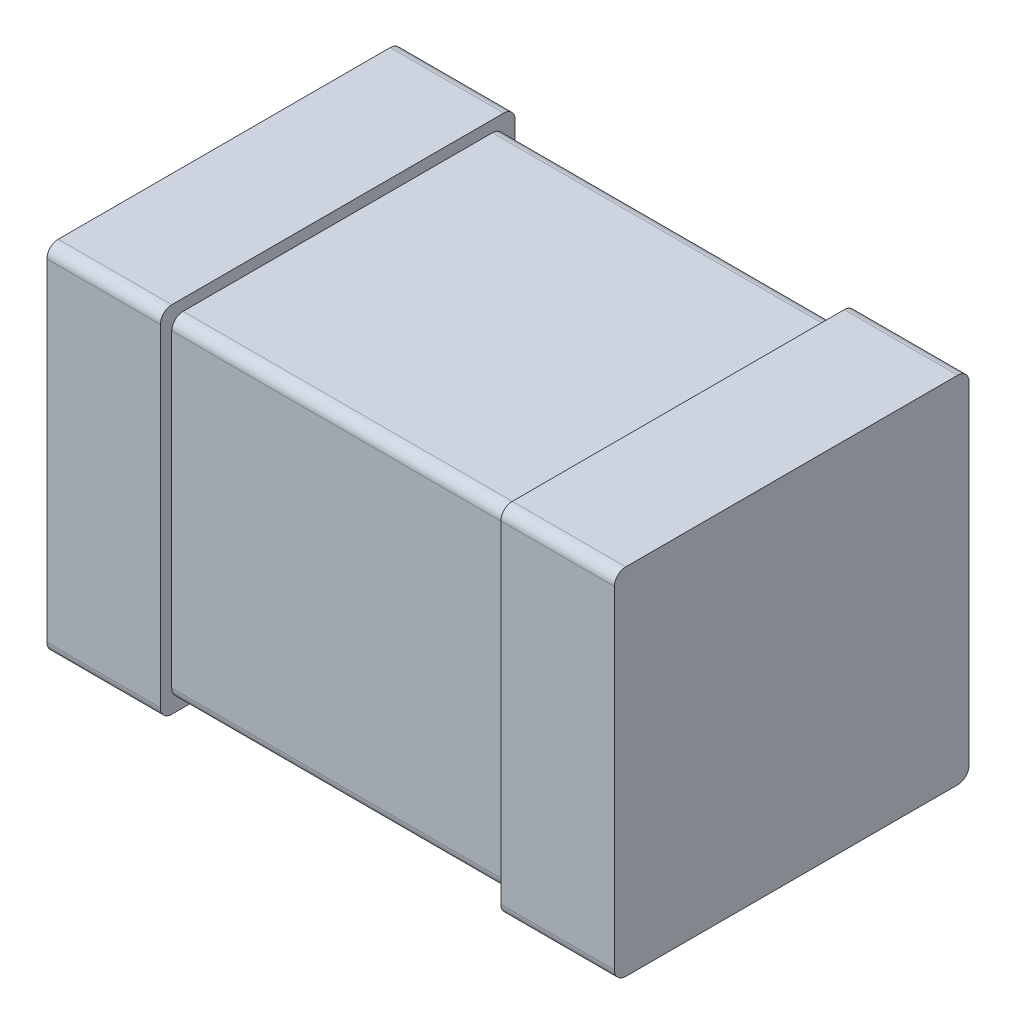
ISO-10303-21;
HEADER;
FILE_DESCRIPTION(('STEP AP214'),'2;1');
FILE_NAME('part.step','',(''),(''),'','','');
FILE_SCHEMA(('AUTOMOTIVE_DESIGN { 1 0 10303 214 1 1 1 1 }'));
ENDSEC;
DATA;
#1=APPLICATION_CONTEXT('core data for automotive mechanical design processes');
#2=APPLICATION_PROTOCOL_DEFINITION('international standard','automotive_design',2000,#1);
#3=PRODUCT_CONTEXT('',#1,'mechanical');
#4=PRODUCT('Part','Part','',(#3));
#5=PRODUCT_RELATED_PRODUCT_CATEGORY('part','',(#4));
#6=PRODUCT_DEFINITION_FORMATION('','',#4);
#7=PRODUCT_DEFINITION_CONTEXT('part definition',#1,'design');
#8=PRODUCT_DEFINITION('design','',#6,#7);
#9=PRODUCT_DEFINITION_SHAPE('','',#8);
#10=(LENGTH_UNIT() NAMED_UNIT(*) SI_UNIT(.MILLI.,.METRE.));
#11=(NAMED_UNIT(*) PLANE_ANGLE_UNIT() SI_UNIT($,.RADIAN.));
#12=(NAMED_UNIT(*) SI_UNIT($,.STERADIAN.) SOLID_ANGLE_UNIT());
#13=UNCERTAINTY_MEASURE_WITH_UNIT(LENGTH_MEASURE(1.E-05),#10,'distance_accuracy_value','');
#14=(GEOMETRIC_REPRESENTATION_CONTEXT(3) GLOBAL_UNCERTAINTY_ASSIGNED_CONTEXT((#13)) GLOBAL_UNIT_ASSIGNED_CONTEXT((#10,
#11,#12)) REPRESENTATION_CONTEXT('',''));
#15=CARTESIAN_POINT('',(0.,0.,0.));
#16=DIRECTION('',(0.,0.,1.));
#17=DIRECTION('',(1.,0.,0.));
#18=AXIS2_PLACEMENT_3D('',#15,#16,#17);
#19=CARTESIAN_POINT('',(1.,-0.625,0.));
#20=DIRECTION('',(1.,0.,0.));
#21=DIRECTION('',(0.,1.,0.));
#22=AXIS2_PLACEMENT_3D('',#19,#20,#21);
#23=PLANE('',#22);
#24=DIRECTION('',(0.,0.,1.));
#25=VECTOR('',#24,1.);
#26=CARTESIAN_POINT('',(1.,-0.625,0.));
#27=LINE('',#26,#25);
#28=CARTESIAN_POINT('',(1.,-0.625,0.04));
#29=VERTEX_POINT('',#28);
#30=CARTESIAN_POINT('',(1.,-0.625,1.21));
#31=VERTEX_POINT('',#30);
#32=EDGE_CURVE('E411',#29,#31,#27,.T.);
#33=ORIENTED_EDGE('',*,*,#32,.F.);
#34=CARTESIAN_POINT('',(1.,-0.585,0.04));
#35=DIRECTION('',(1.,0.,0.));
#36=DIRECTION('',(0.,0.,1.));
#37=AXIS2_PLACEMENT_3D('',#34,#35,#36);
#38=CIRCLE('',#37,0.04);
#39=CARTESIAN_POINT('',(1.,-0.585,0.));
#40=VERTEX_POINT('',#39);
#41=EDGE_CURVE('E402',#29,#40,#38,.T.);
#42=ORIENTED_EDGE('',*,*,#41,.T.);
#43=DIRECTION('',(0.,1.,0.));
#44=VECTOR('',#43,1.);
#45=CARTESIAN_POINT('',(1.,-0.625,0.));
#46=LINE('',#45,#44);
#47=CARTESIAN_POINT('',(1.,0.585,0.));
#48=VERTEX_POINT('',#47);
#49=EDGE_CURVE('E466',#40,#48,#46,.T.);
#50=ORIENTED_EDGE('',*,*,#49,.T.);
#51=CARTESIAN_POINT('',(1.,0.585,0.04));
#52=DIRECTION('',(-1.,0.,0.));
#53=DIRECTION('',(0.,0.,1.));
#54=AXIS2_PLACEMENT_3D('',#51,#52,#53);
#55=CIRCLE('',#54,0.04);
#56=CARTESIAN_POINT('',(1.,0.625,0.04));
#57=VERTEX_POINT('',#56);
#58=EDGE_CURVE('E503',#57,#48,#55,.T.);
#59=ORIENTED_EDGE('',*,*,#58,.F.);
#60=DIRECTION('',(0.,0.,1.));
#61=VECTOR('',#60,1.);
#62=CARTESIAN_POINT('',(1.,0.625,0.));
#63=LINE('',#62,#61);
#64=CARTESIAN_POINT('',(1.,0.625,1.21));
#65=VERTEX_POINT('',#64);
#66=EDGE_CURVE('E11',#57,#65,#63,.T.);
#67=ORIENTED_EDGE('',*,*,#66,.T.);
#68=CARTESIAN_POINT('',(1.,0.585,1.21));
#69=DIRECTION('',(1.,0.,0.));
#70=DIRECTION('',(0.,0.,1.));
#71=AXIS2_PLACEMENT_3D('',#68,#69,#70);
#72=CIRCLE('',#71,0.04);
#73=CARTESIAN_POINT('',(1.,0.585,1.25));
#74=VERTEX_POINT('',#73);
#75=EDGE_CURVE('E506',#65,#74,#72,.T.);
#76=ORIENTED_EDGE('',*,*,#75,.T.);
#77=DIRECTION('',(0.,1.,0.));
#78=VECTOR('',#77,1.);
#79=CARTESIAN_POINT('',(1.,-0.625,1.25));
#80=LINE('',#79,#78);
#81=CARTESIAN_POINT('',(1.,-0.585,1.25));
#82=VERTEX_POINT('',#81);
#83=EDGE_CURVE('E461',#82,#74,#80,.T.);
#84=ORIENTED_EDGE('',*,*,#83,.F.);
#85=CARTESIAN_POINT('',(1.,-0.585,1.21));
#86=DIRECTION('',(-1.,0.,0.));
#87=DIRECTION('',(0.,0.,1.));
#88=AXIS2_PLACEMENT_3D('',#85,#86,#87);
#89=CIRCLE('',#88,0.04);
#90=EDGE_CURVE('E301',#31,#82,#89,.T.);
#91=ORIENTED_EDGE('',*,*,#90,.F.);
#92=EDGE_LOOP('',(#33,#42,#50,#59,#67,#76,#84,#91));
#93=FACE_BOUND('',#92,.T.);
#94=ADVANCED_FACE('F17',(#93),#23,.T.);
#95=CARTESIAN_POINT('',(0.6,0.625,0.));
#96=DIRECTION('',(0.,1.,0.));
#97=DIRECTION('',(1.,0.,0.));
#98=AXIS2_PLACEMENT_3D('',#95,#96,#97);
#99=PLANE('',#98);
#100=ORIENTED_EDGE('',*,*,#66,.F.);
#101=DIRECTION('',(1.,0.,0.));
#102=VECTOR('',#101,1.);
#103=CARTESIAN_POINT('',(0.6,0.625,0.04));
#104=LINE('',#103,#102);
#105=CARTESIAN_POINT('',(0.6,0.625,0.04));
#106=VERTEX_POINT('',#105);
#107=EDGE_CURVE('E499',#106,#57,#104,.T.);
#108=ORIENTED_EDGE('',*,*,#107,.F.);
#109=DIRECTION('',(0.,0.,1.));
#110=VECTOR('',#109,1.);
#111=CARTESIAN_POINT('',(0.6,0.625,0.));
#112=LINE('',#111,#110);
#113=CARTESIAN_POINT('',(0.6,0.625,1.21));
#114=VERTEX_POINT('',#113);
#115=EDGE_CURVE('E456',#106,#114,#112,.T.);
#116=ORIENTED_EDGE('',*,*,#115,.T.);
#117=DIRECTION('',(1.,0.,0.));
#118=VECTOR('',#117,1.);
#119=CARTESIAN_POINT('',(0.6,0.625,1.21));
#120=LINE('',#119,#118);
#121=EDGE_CURVE('E25',#114,#65,#120,.T.);
#122=ORIENTED_EDGE('',*,*,#121,.T.);
#123=EDGE_LOOP('',(#100,#108,#116,#122));
#124=FACE_BOUND('',#123,.T.);
#125=ADVANCED_FACE('F511',(#124),#99,.T.);
#126=CARTESIAN_POINT('',(0.6,0.585,1.21));
#127=DIRECTION('',(1.,0.,0.));
#128=DIRECTION('',(0.,1.,0.));
#129=AXIS2_PLACEMENT_3D('',#126,#127,#128);
#130=CYLINDRICAL_SURFACE('',#129,0.04);
#131=CARTESIAN_POINT('',(0.6,0.585,1.21));
#132=DIRECTION('',(1.,0.,0.));
#133=DIRECTION('',(0.,0.,1.));
#134=AXIS2_PLACEMENT_3D('',#131,#132,#133);
#135=CIRCLE('',#134,0.04);
#136=CARTESIAN_POINT('',(0.6,0.585,1.25));
#137=VERTEX_POINT('',#136);
#138=EDGE_CURVE('E452',#114,#137,#135,.T.);
#139=ORIENTED_EDGE('',*,*,#138,.T.);
#140=DIRECTION('',(1.,0.,0.));
#141=VECTOR('',#140,1.);
#142=CARTESIAN_POINT('',(0.6,0.585,1.25));
#143=LINE('',#142,#141);
#144=EDGE_CURVE('E465',#137,#74,#143,.T.);
#145=ORIENTED_EDGE('',*,*,#144,.T.);
#146=ORIENTED_EDGE('',*,*,#75,.F.);
#147=ORIENTED_EDGE('',*,*,#121,.F.);
#148=EDGE_LOOP('',(#139,#145,#146,#147));
#149=FACE_BOUND('',#148,.T.);
#150=ADVANCED_FACE('F515',(#149),#130,.T.);
#151=CARTESIAN_POINT('',(0.6,0.585,0.04));
#152=DIRECTION('',(1.,0.,0.));
#153=DIRECTION('',(0.,1.,0.));
#154=AXIS2_PLACEMENT_3D('',#151,#152,#153);
#155=CYLINDRICAL_SURFACE('',#154,0.04);
#156=ORIENTED_EDGE('',*,*,#107,.T.);
#157=ORIENTED_EDGE('',*,*,#58,.T.);
#158=DIRECTION('',(1.,0.,0.));
#159=VECTOR('',#158,1.);
#160=CARTESIAN_POINT('',(0.6,0.585,0.));
#161=LINE('',#160,#159);
#162=CARTESIAN_POINT('',(0.6,0.585,0.));
#163=VERTEX_POINT('',#162);
#164=EDGE_CURVE('E300',#163,#48,#161,.T.);
#165=ORIENTED_EDGE('',*,*,#164,.F.);
#166=CARTESIAN_POINT('',(0.6,0.585,0.04));
#167=DIRECTION('',(-1.,0.,0.));
#168=DIRECTION('',(0.,0.,1.));
#169=AXIS2_PLACEMENT_3D('',#166,#167,#168);
#170=CIRCLE('',#169,0.04);
#171=EDGE_CURVE('E460',#106,#163,#170,.T.);
#172=ORIENTED_EDGE('',*,*,#171,.F.);
#173=EDGE_LOOP('',(#156,#157,#165,#172));
#174=FACE_BOUND('',#173,.T.);
#175=ADVANCED_FACE('F536',(#174),#155,.T.);
#176=CARTESIAN_POINT('',(0.6,-0.625,1.25));
#177=DIRECTION('',(0.,0.,1.));
#178=DIRECTION('',(1.,0.,0.));
#179=AXIS2_PLACEMENT_3D('',#176,#177,#178);
#180=PLANE('',#179);
#181=DIRECTION('',(0.,1.,0.));
#182=VECTOR('',#181,1.);
#183=CARTESIAN_POINT('',(0.6,-0.625,1.25));
#184=LINE('',#183,#182);
#185=CARTESIAN_POINT('',(0.6,-0.585,1.25));
#186=VERTEX_POINT('',#185);
#187=EDGE_CURVE('E448',#186,#137,#184,.T.);
#188=ORIENTED_EDGE('',*,*,#187,.F.);
#189=DIRECTION('',(1.,0.,0.));
#190=VECTOR('',#189,1.);
#191=CARTESIAN_POINT('',(0.6,-0.585,1.25));
#192=LINE('',#191,#190);
#193=EDGE_CURVE('E296',#186,#82,#192,.T.);
#194=ORIENTED_EDGE('',*,*,#193,.T.);
#195=ORIENTED_EDGE('',*,*,#83,.T.);
#196=ORIENTED_EDGE('',*,*,#144,.F.);
#197=EDGE_LOOP('',(#188,#194,#195,#196));
#198=FACE_BOUND('',#197,.T.);
#199=ADVANCED_FACE('F519',(#198),#180,.T.);
#200=CARTESIAN_POINT('',(0.6,-0.625,0.));
#201=DIRECTION('',(0.,0.,1.));
#202=DIRECTION('',(1.,0.,0.));
#203=AXIS2_PLACEMENT_3D('',#200,#201,#202);
#204=PLANE('',#203);
#205=ORIENTED_EDGE('',*,*,#164,.T.);
#206=ORIENTED_EDGE('',*,*,#49,.F.);
#207=DIRECTION('',(1.,0.,0.));
#208=VECTOR('',#207,1.);
#209=CARTESIAN_POINT('',(0.6,-0.585,0.));
#210=LINE('',#209,#208);
#211=CARTESIAN_POINT('',(0.6,-0.585,0.));
#212=VERTEX_POINT('',#211);
#213=EDGE_CURVE('E407',#212,#40,#210,.T.);
#214=ORIENTED_EDGE('',*,*,#213,.F.);
#215=DIRECTION('',(0.,1.,0.));
#216=VECTOR('',#215,1.);
#217=CARTESIAN_POINT('',(0.6,-0.625,0.));
#218=LINE('',#217,#216);
#219=EDGE_CURVE('E390',#212,#163,#218,.T.);
#220=ORIENTED_EDGE('',*,*,#219,.T.);
#221=EDGE_LOOP('',(#205,#206,#214,#220));
#222=FACE_BOUND('',#221,.T.);
#223=ADVANCED_FACE('F533',(#222),#204,.F.);
#224=CARTESIAN_POINT('',(0.6,-0.585,1.21));
#225=DIRECTION('',(1.,0.,0.));
#226=DIRECTION('',(0.,-1.,0.));
#227=AXIS2_PLACEMENT_3D('',#224,#225,#226);
#228=CYLINDRICAL_SURFACE('',#227,0.04);
#229=DIRECTION('',(1.,0.,0.));
#230=VECTOR('',#229,1.);
#231=CARTESIAN_POINT('',(0.6,-0.625,1.21));
#232=LINE('',#231,#230);
#233=CARTESIAN_POINT('',(0.6,-0.625,1.21));
#234=VERTEX_POINT('',#233);
#235=EDGE_CURVE('E476',#234,#31,#232,.T.);
#236=ORIENTED_EDGE('',*,*,#235,.T.);
#237=ORIENTED_EDGE('',*,*,#90,.T.);
#238=ORIENTED_EDGE('',*,*,#193,.F.);
#239=CARTESIAN_POINT('',(0.6,-0.585,1.21));
#240=DIRECTION('',(-1.,0.,0.));
#241=DIRECTION('',(0.,0.,1.));
#242=AXIS2_PLACEMENT_3D('',#239,#240,#241);
#243=CIRCLE('',#242,0.04);
#244=EDGE_CURVE('E444',#234,#186,#243,.T.);
#245=ORIENTED_EDGE('',*,*,#244,.F.);
#246=EDGE_LOOP('',(#236,#237,#238,#245));
#247=FACE_BOUND('',#246,.T.);
#248=ADVANCED_FACE('F522',(#247),#228,.T.);
#249=CARTESIAN_POINT('',(0.6,-0.585,0.04));
#250=DIRECTION('',(1.,0.,0.));
#251=DIRECTION('',(0.,-1.,0.));
#252=AXIS2_PLACEMENT_3D('',#249,#250,#251);
#253=CYLINDRICAL_SURFACE('',#252,0.04);
#254=CARTESIAN_POINT('',(0.6,-0.585,0.04));
#255=DIRECTION('',(1.,0.,0.));
#256=DIRECTION('',(0.,0.,1.));
#257=AXIS2_PLACEMENT_3D('',#254,#255,#256);
#258=CIRCLE('',#257,0.04);
#259=CARTESIAN_POINT('',(0.6,-0.625,0.04));
#260=VERTEX_POINT('',#259);
#261=EDGE_CURVE('E385',#260,#212,#258,.T.);
#262=ORIENTED_EDGE('',*,*,#261,.T.);
#263=ORIENTED_EDGE('',*,*,#213,.T.);
#264=ORIENTED_EDGE('',*,*,#41,.F.);
#265=DIRECTION('',(1.,0.,0.));
#266=VECTOR('',#265,1.);
#267=CARTESIAN_POINT('',(0.6,-0.625,0.04));
#268=LINE('',#267,#266);
#269=EDGE_CURVE('E480',#260,#29,#268,.T.);
#270=ORIENTED_EDGE('',*,*,#269,.F.);
#271=EDGE_LOOP('',(#262,#263,#264,#270));
#272=FACE_BOUND('',#271,.T.);
#273=ADVANCED_FACE('F531',(#272),#253,.T.);
#274=CARTESIAN_POINT('',(0.6,-0.625,0.));
#275=DIRECTION('',(0.,1.,0.));
#276=DIRECTION('',(1.,0.,0.));
#277=AXIS2_PLACEMENT_3D('',#274,#275,#276);
#278=PLANE('',#277);
#279=ORIENTED_EDGE('',*,*,#235,.F.);
#280=DIRECTION('',(0.,0.,1.));
#281=VECTOR('',#280,1.);
#282=CARTESIAN_POINT('',(0.6,-0.625,0.));
#283=LINE('',#282,#281);
#284=EDGE_CURVE('E389',#260,#234,#283,.T.);
#285=ORIENTED_EDGE('',*,*,#284,.F.);
#286=ORIENTED_EDGE('',*,*,#269,.T.);
#287=ORIENTED_EDGE('',*,*,#32,.T.);
#288=EDGE_LOOP('',(#279,#285,#286,#287));
#289=FACE_BOUND('',#288,.T.);
#290=ADVANCED_FACE('F525',(#289),#278,.F.);
#291=CARTESIAN_POINT('',(0.6,-0.625,0.));
#292=DIRECTION('',(1.,0.,0.));
#293=DIRECTION('',(0.,1.,0.));
#294=AXIS2_PLACEMENT_3D('',#291,#292,#293);
#295=PLANE('',#294);
#296=DIRECTION('',(0.,1.,0.));
#297=VECTOR('',#296,1.);
#298=CARTESIAN_POINT('',(0.6,-0.585,0.04));
#299=LINE('',#298,#297);
#300=CARTESIAN_POINT('',(0.6,-0.545,0.04));
#301=VERTEX_POINT('',#300);
#302=CARTESIAN_POINT('',(0.6,0.545,0.04));
#303=VERTEX_POINT('',#302);
#304=EDGE_CURVE('E406',#301,#303,#299,.T.);
#305=ORIENTED_EDGE('',*,*,#304,.T.);
#306=CARTESIAN_POINT('',(0.6,0.545,0.08));
#307=DIRECTION('',(-1.,0.,0.));
#308=DIRECTION('',(0.,0.,1.));
#309=AXIS2_PLACEMENT_3D('',#306,#307,#308);
#310=CIRCLE('',#309,0.04);
#311=CARTESIAN_POINT('',(0.6,0.585,0.08));
#312=VERTEX_POINT('',#311);
#313=EDGE_CURVE('E350',#312,#303,#310,.T.);
#314=ORIENTED_EDGE('',*,*,#313,.F.);
#315=DIRECTION('',(0.,0.,1.));
#316=VECTOR('',#315,1.);
#317=CARTESIAN_POINT('',(0.6,0.585,0.04));
#318=LINE('',#317,#316);
#319=CARTESIAN_POINT('',(0.6,0.585,1.17));
#320=VERTEX_POINT('',#319);
#321=EDGE_CURVE('E345',#312,#320,#318,.T.);
#322=ORIENTED_EDGE('',*,*,#321,.T.);
#323=CARTESIAN_POINT('',(0.6,0.545,1.17));
#324=DIRECTION('',(1.,0.,0.));
#325=DIRECTION('',(0.,0.,1.));
#326=AXIS2_PLACEMENT_3D('',#323,#324,#325);
#327=CIRCLE('',#326,0.04);
#328=CARTESIAN_POINT('',(0.6,0.545,1.21));
#329=VERTEX_POINT('',#328);
#330=EDGE_CURVE('E428',#320,#329,#327,.T.);
#331=ORIENTED_EDGE('',*,*,#330,.T.);
#332=DIRECTION('',(0.,1.,0.));
#333=VECTOR('',#332,1.);
#334=CARTESIAN_POINT('',(0.6,-0.585,1.21));
#335=LINE('',#334,#333);
#336=CARTESIAN_POINT('',(0.6,-0.545,1.21));
#337=VERTEX_POINT('',#336);
#338=EDGE_CURVE('E377',#337,#329,#335,.T.);
#339=ORIENTED_EDGE('',*,*,#338,.F.);
#340=CARTESIAN_POINT('',(0.6,-0.545,1.17));
#341=DIRECTION('',(-1.,0.,0.));
#342=DIRECTION('',(0.,0.,1.));
#343=AXIS2_PLACEMENT_3D('',#340,#341,#342);
#344=CIRCLE('',#343,0.04);
#345=CARTESIAN_POINT('',(0.6,-0.585,1.17));
#346=VERTEX_POINT('',#345);
#347=EDGE_CURVE('E438',#346,#337,#344,.T.);
#348=ORIENTED_EDGE('',*,*,#347,.F.);
#349=DIRECTION('',(0.,0.,1.));
#350=VECTOR('',#349,1.);
#351=CARTESIAN_POINT('',(0.6,-0.585,0.04));
#352=LINE('',#351,#350);
#353=CARTESIAN_POINT('',(0.6,-0.585,0.08));
#354=VERTEX_POINT('',#353);
#355=EDGE_CURVE('E441',#354,#346,#352,.T.);
#356=ORIENTED_EDGE('',*,*,#355,.F.);
#357=CARTESIAN_POINT('',(0.6,-0.545,0.08));
#358=DIRECTION('',(1.,0.,0.));
#359=DIRECTION('',(0.,0.,1.));
#360=AXIS2_PLACEMENT_3D('',#357,#358,#359);
#361=CIRCLE('',#360,0.04);
#362=EDGE_CURVE('E331',#354,#301,#361,.T.);
#363=ORIENTED_EDGE('',*,*,#362,.T.);
#364=EDGE_LOOP('',(#305,#314,#322,#331,#339,#348,#356,#363));
#365=FACE_BOUND('',#364,.T.);
#366=ORIENTED_EDGE('',*,*,#244,.T.);
#367=ORIENTED_EDGE('',*,*,#187,.T.);
#368=ORIENTED_EDGE('',*,*,#138,.F.);
#369=ORIENTED_EDGE('',*,*,#115,.F.);
#370=ORIENTED_EDGE('',*,*,#171,.T.);
#371=ORIENTED_EDGE('',*,*,#219,.F.);
#372=ORIENTED_EDGE('',*,*,#261,.F.);
#373=ORIENTED_EDGE('',*,*,#284,.T.);
#374=EDGE_LOOP('',(#366,#367,#368,#369,#370,#371,#372,#373));
#375=FACE_BOUND('',#374,.T.);
#376=ADVANCED_FACE('F528',(#365,#375),#295,.F.);
#377=CARTESIAN_POINT('',(-0.6,-0.585,0.04));
#378=DIRECTION('',(0.,1.,0.));
#379=DIRECTION('',(1.,0.,0.));
#380=AXIS2_PLACEMENT_3D('',#377,#378,#379);
#381=PLANE('',#380);
#382=DIRECTION('',(1.,0.,0.));
#383=VECTOR('',#382,1.);
#384=CARTESIAN_POINT('',(-0.6,-0.585,1.17));
#385=LINE('',#384,#383);
#386=CARTESIAN_POINT('',(-0.6,-0.585,1.17));
#387=VERTEX_POINT('',#386);
#388=EDGE_CURVE('E380',#387,#346,#385,.T.);
#389=ORIENTED_EDGE('',*,*,#388,.F.);
#390=DIRECTION('',(0.,0.,1.));
#391=VECTOR('',#390,1.);
#392=CARTESIAN_POINT('',(-0.6,-0.585,0.04));
#393=LINE('',#392,#391);
#394=CARTESIAN_POINT('',(-0.6,-0.585,0.08));
#395=VERTEX_POINT('',#394);
#396=EDGE_CURVE('E339',#395,#387,#393,.T.);
#397=ORIENTED_EDGE('',*,*,#396,.F.);
#398=DIRECTION('',(1.,0.,0.));
#399=VECTOR('',#398,1.);
#400=CARTESIAN_POINT('',(-0.6,-0.585,0.08));
#401=LINE('',#400,#399);
#402=EDGE_CURVE('E394',#395,#354,#401,.T.);
#403=ORIENTED_EDGE('',*,*,#402,.T.);
#404=ORIENTED_EDGE('',*,*,#355,.T.);
#405=EDGE_LOOP('',(#389,#397,#403,#404));
#406=FACE_BOUND('',#405,.T.);
#407=ADVANCED_FACE('F623',(#406),#381,.F.);
#408=CARTESIAN_POINT('',(-0.6,-0.545,1.17));
#409=DIRECTION('',(1.,0.,0.));
#410=DIRECTION('',(0.,-1.,0.));
#411=AXIS2_PLACEMENT_3D('',#408,#409,#410);
#412=CYLINDRICAL_SURFACE('',#411,0.04);
#413=ORIENTED_EDGE('',*,*,#388,.T.);
#414=ORIENTED_EDGE('',*,*,#347,.T.);
#415=DIRECTION('',(1.,0.,0.));
#416=VECTOR('',#415,1.);
#417=CARTESIAN_POINT('',(-0.6,-0.545,1.21));
#418=LINE('',#417,#416);
#419=CARTESIAN_POINT('',(-0.6,-0.545,1.21));
#420=VERTEX_POINT('',#419);
#421=EDGE_CURVE('E381',#420,#337,#418,.T.);
#422=ORIENTED_EDGE('',*,*,#421,.F.);
#423=CARTESIAN_POINT('',(-0.6,-0.545,1.17));
#424=DIRECTION('',(-1.,0.,0.));
#425=DIRECTION('',(0.,0.,1.));
#426=AXIS2_PLACEMENT_3D('',#423,#424,#425);
#427=CIRCLE('',#426,0.04);
#428=EDGE_CURVE('E357',#387,#420,#427,.T.);
#429=ORIENTED_EDGE('',*,*,#428,.F.);
#430=EDGE_LOOP('',(#413,#414,#422,#429));
#431=FACE_BOUND('',#430,.T.);
#432=ADVANCED_FACE('F636',(#431),#412,.T.);
#433=CARTESIAN_POINT('',(-0.6,-0.585,1.21));
#434=DIRECTION('',(0.,0.,1.));
#435=DIRECTION('',(1.,0.,0.));
#436=AXIS2_PLACEMENT_3D('',#433,#434,#435);
#437=PLANE('',#436);
#438=DIRECTION('',(0.,1.,0.));
#439=VECTOR('',#438,1.);
#440=CARTESIAN_POINT('',(-0.6,-0.585,1.21));
#441=LINE('',#440,#439);
#442=CARTESIAN_POINT('',(-0.6,0.545,1.21));
#443=VERTEX_POINT('',#442);
#444=EDGE_CURVE('E361',#420,#443,#441,.T.);
#445=ORIENTED_EDGE('',*,*,#444,.F.);
#446=ORIENTED_EDGE('',*,*,#421,.T.);
#447=ORIENTED_EDGE('',*,*,#338,.T.);
#448=DIRECTION('',(1.,0.,0.));
#449=VECTOR('',#448,1.);
#450=CARTESIAN_POINT('',(-0.6,0.545,1.21));
#451=LINE('',#450,#449);
#452=EDGE_CURVE('E424',#443,#329,#451,.T.);
#453=ORIENTED_EDGE('',*,*,#452,.F.);
#454=EDGE_LOOP('',(#445,#446,#447,#453));
#455=FACE_BOUND('',#454,.T.);
#456=ADVANCED_FACE('F651',(#455),#437,.T.);
#457=CARTESIAN_POINT('',(-0.6,0.545,1.17));
#458=DIRECTION('',(1.,0.,0.));
#459=DIRECTION('',(0.,1.,0.));
#460=AXIS2_PLACEMENT_3D('',#457,#458,#459);
#461=CYLINDRICAL_SURFACE('',#460,0.04);
#462=CARTESIAN_POINT('',(-0.6,0.545,1.17));
#463=DIRECTION('',(1.,0.,0.));
#464=DIRECTION('',(0.,0.,1.));
#465=AXIS2_PLACEMENT_3D('',#462,#463,#464);
#466=CIRCLE('',#465,0.04);
#467=CARTESIAN_POINT('',(-0.6,0.585,1.17));
#468=VERTEX_POINT('',#467);
#469=EDGE_CURVE('E365',#468,#443,#466,.T.);
#470=ORIENTED_EDGE('',*,*,#469,.T.);
#471=ORIENTED_EDGE('',*,*,#452,.T.);
#472=ORIENTED_EDGE('',*,*,#330,.F.);
#473=DIRECTION('',(1.,0.,0.));
#474=VECTOR('',#473,1.);
#475=CARTESIAN_POINT('',(-0.6,0.585,1.17));
#476=LINE('',#475,#474);
#477=EDGE_CURVE('E349',#468,#320,#476,.T.);
#478=ORIENTED_EDGE('',*,*,#477,.F.);
#479=EDGE_LOOP('',(#470,#471,#472,#478));
#480=FACE_BOUND('',#479,.T.);
#481=ADVANCED_FACE('F665',(#480),#461,.T.);
#482=CARTESIAN_POINT('',(-0.6,0.585,0.04));
#483=DIRECTION('',(0.,1.,0.));
#484=DIRECTION('',(1.,0.,0.));
#485=AXIS2_PLACEMENT_3D('',#482,#483,#484);
#486=PLANE('',#485);
#487=ORIENTED_EDGE('',*,*,#321,.F.);
#488=DIRECTION('',(1.,0.,0.));
#489=VECTOR('',#488,1.);
#490=CARTESIAN_POINT('',(-0.6,0.585,0.08));
#491=LINE('',#490,#489);
#492=CARTESIAN_POINT('',(-0.6,0.585,0.08));
#493=VERTEX_POINT('',#492);
#494=EDGE_CURVE('E415',#493,#312,#491,.T.);
#495=ORIENTED_EDGE('',*,*,#494,.F.);
#496=DIRECTION('',(0.,0.,1.));
#497=VECTOR('',#496,1.);
#498=CARTESIAN_POINT('',(-0.6,0.585,0.04));
#499=LINE('',#498,#497);
#500=EDGE_CURVE('E369',#493,#468,#499,.T.);
#501=ORIENTED_EDGE('',*,*,#500,.T.);
#502=ORIENTED_EDGE('',*,*,#477,.T.);
#503=EDGE_LOOP('',(#487,#495,#501,#502));
#504=FACE_BOUND('',#503,.T.);
#505=ADVANCED_FACE('F679',(#504),#486,.T.);
#506=CARTESIAN_POINT('',(-0.6,0.545,0.08));
#507=DIRECTION('',(1.,0.,0.));
#508=DIRECTION('',(0.,1.,0.));
#509=AXIS2_PLACEMENT_3D('',#506,#507,#508);
#510=CYLINDRICAL_SURFACE('',#509,0.04);
#511=ORIENTED_EDGE('',*,*,#494,.T.);
#512=ORIENTED_EDGE('',*,*,#313,.T.);
#513=DIRECTION('',(1.,0.,0.));
#514=VECTOR('',#513,1.);
#515=CARTESIAN_POINT('',(-0.6,0.545,0.04));
#516=LINE('',#515,#514);
#517=CARTESIAN_POINT('',(-0.6,0.545,0.04));
#518=VERTEX_POINT('',#517);
#519=EDGE_CURVE('E398',#518,#303,#516,.T.);
#520=ORIENTED_EDGE('',*,*,#519,.F.);
#521=CARTESIAN_POINT('',(-0.6,0.545,0.08));
#522=DIRECTION('',(-1.,0.,0.));
#523=DIRECTION('',(0.,0.,1.));
#524=AXIS2_PLACEMENT_3D('',#521,#522,#523);
#525=CIRCLE('',#524,0.04);
#526=EDGE_CURVE('E373',#493,#518,#525,.T.);
#527=ORIENTED_EDGE('',*,*,#526,.F.);
#528=EDGE_LOOP('',(#511,#512,#520,#527));
#529=FACE_BOUND('',#528,.T.);
#530=ADVANCED_FACE('F694',(#529),#510,.T.);
#531=CARTESIAN_POINT('',(-0.6,-0.585,0.04));
#532=DIRECTION('',(0.,0.,1.));
#533=DIRECTION('',(1.,0.,0.));
#534=AXIS2_PLACEMENT_3D('',#531,#532,#533);
#535=PLANE('',#534);
#536=ORIENTED_EDGE('',*,*,#519,.T.);
#537=ORIENTED_EDGE('',*,*,#304,.F.);
#538=DIRECTION('',(1.,0.,0.));
#539=VECTOR('',#538,1.);
#540=CARTESIAN_POINT('',(-0.6,-0.545,0.04));
#541=LINE('',#540,#539);
#542=CARTESIAN_POINT('',(-0.6,-0.545,0.04));
#543=VERTEX_POINT('',#542);
#544=EDGE_CURVE('E327',#543,#301,#541,.T.);
#545=ORIENTED_EDGE('',*,*,#544,.F.);
#546=DIRECTION('',(0.,1.,0.));
#547=VECTOR('',#546,1.);
#548=CARTESIAN_POINT('',(-0.6,-0.585,0.04));
#549=LINE('',#548,#547);
#550=EDGE_CURVE('E332',#543,#518,#549,.T.);
#551=ORIENTED_EDGE('',*,*,#550,.T.);
#552=EDGE_LOOP('',(#536,#537,#545,#551));
#553=FACE_BOUND('',#552,.T.);
#554=ADVANCED_FACE('F708',(#553),#535,.F.);
#555=CARTESIAN_POINT('',(-0.6,-0.545,0.08));
#556=DIRECTION('',(1.,0.,0.));
#557=DIRECTION('',(0.,-1.,0.));
#558=AXIS2_PLACEMENT_3D('',#555,#556,#557);
#559=CYLINDRICAL_SURFACE('',#558,0.04);
#560=CARTESIAN_POINT('',(-0.6,-0.545,0.08));
#561=DIRECTION('',(1.,0.,0.));
#562=DIRECTION('',(0.,0.,1.));
#563=AXIS2_PLACEMENT_3D('',#560,#561,#562);
#564=CIRCLE('',#563,0.04);
#565=EDGE_CURVE('E276',#395,#543,#564,.T.);
#566=ORIENTED_EDGE('',*,*,#565,.T.);
#567=ORIENTED_EDGE('',*,*,#544,.T.);
#568=ORIENTED_EDGE('',*,*,#362,.F.);
#569=ORIENTED_EDGE('',*,*,#402,.F.);
#570=EDGE_LOOP('',(#566,#567,#568,#569));
#571=FACE_BOUND('',#570,.T.);
#572=ADVANCED_FACE('F721',(#571),#559,.T.);
#573=CARTESIAN_POINT('',(-0.6,-0.625,0.));
#574=DIRECTION('',(1.,0.,0.));
#575=DIRECTION('',(0.,1.,0.));
#576=AXIS2_PLACEMENT_3D('',#573,#574,#575);
#577=PLANE('',#576);
#578=ORIENTED_EDGE('',*,*,#565,.F.);
#579=ORIENTED_EDGE('',*,*,#396,.T.);
#580=ORIENTED_EDGE('',*,*,#428,.T.);
#581=ORIENTED_EDGE('',*,*,#444,.T.);
#582=ORIENTED_EDGE('',*,*,#469,.F.);
#583=ORIENTED_EDGE('',*,*,#500,.F.);
#584=ORIENTED_EDGE('',*,*,#526,.T.);
#585=ORIENTED_EDGE('',*,*,#550,.F.);
#586=EDGE_LOOP('',(#578,#579,#580,#581,#582,#583,#584,#585));
#587=FACE_BOUND('',#586,.T.);
#588=DIRECTION('',(0.,0.,1.));
#589=VECTOR('',#588,1.);
#590=CARTESIAN_POINT('',(-0.6,-0.625,0.));
#591=LINE('',#590,#589);
#592=CARTESIAN_POINT('',(-0.6,-0.625,0.04));
#593=VERTEX_POINT('',#592);
#594=CARTESIAN_POINT('',(-0.6,-0.625,1.21));
#595=VERTEX_POINT('',#594);
#596=EDGE_CURVE('E235',#593,#595,#591,.T.);
#597=ORIENTED_EDGE('',*,*,#596,.F.);
#598=CARTESIAN_POINT('',(-0.6,-0.585,0.04));
#599=DIRECTION('',(1.,0.,0.));
#600=DIRECTION('',(0.,0.,1.));
#601=AXIS2_PLACEMENT_3D('',#598,#599,#600);
#602=CIRCLE('',#601,0.04);
#603=CARTESIAN_POINT('',(-0.6,-0.585,0.));
#604=VERTEX_POINT('',#603);
#605=EDGE_CURVE('E272',#593,#604,#602,.T.);
#606=ORIENTED_EDGE('',*,*,#605,.T.);
#607=DIRECTION('',(0.,1.,0.));
#608=VECTOR('',#607,1.);
#609=CARTESIAN_POINT('',(-0.6,-0.625,0.));
#610=LINE('',#609,#608);
#611=CARTESIAN_POINT('',(-0.6,0.585,0.));
#612=VERTEX_POINT('',#611);
#613=EDGE_CURVE('E313',#604,#612,#610,.T.);
#614=ORIENTED_EDGE('',*,*,#613,.T.);
#615=CARTESIAN_POINT('',(-0.6,0.585,0.04));
#616=DIRECTION('',(-1.,0.,0.));
#617=DIRECTION('',(0.,0.,1.));
#618=AXIS2_PLACEMENT_3D('',#615,#616,#617);
#619=CIRCLE('',#618,0.04);
#620=CARTESIAN_POINT('',(-0.6,0.625,0.04));
#621=VERTEX_POINT('',#620);
#622=EDGE_CURVE('E306',#621,#612,#619,.T.);
#623=ORIENTED_EDGE('',*,*,#622,.F.);
#624=DIRECTION('',(0.,0.,1.));
#625=VECTOR('',#624,1.);
#626=CARTESIAN_POINT('',(-0.6,0.625,0.));
#627=LINE('',#626,#625);
#628=CARTESIAN_POINT('',(-0.6,0.625,1.21));
#629=VERTEX_POINT('',#628);
#630=EDGE_CURVE('E273',#621,#629,#627,.T.);
#631=ORIENTED_EDGE('',*,*,#630,.T.);
#632=CARTESIAN_POINT('',(-0.6,0.585,1.21));
#633=DIRECTION('',(1.,0.,0.));
#634=DIRECTION('',(0.,0.,1.));
#635=AXIS2_PLACEMENT_3D('',#632,#633,#634);
#636=CIRCLE('',#635,0.04);
#637=CARTESIAN_POINT('',(-0.6,0.585,1.25));
#638=VERTEX_POINT('',#637);
#639=EDGE_CURVE('E342',#629,#638,#636,.T.);
#640=ORIENTED_EDGE('',*,*,#639,.T.);
#641=DIRECTION('',(0.,1.,0.));
#642=VECTOR('',#641,1.);
#643=CARTESIAN_POINT('',(-0.6,-0.625,1.25));
#644=LINE('',#643,#642);
#645=CARTESIAN_POINT('',(-0.6,-0.585,1.25));
#646=VERTEX_POINT('',#645);
#647=EDGE_CURVE('E317',#646,#638,#644,.T.);
#648=ORIENTED_EDGE('',*,*,#647,.F.);
#649=CARTESIAN_POINT('',(-0.6,-0.585,1.21));
#650=DIRECTION('',(-1.,0.,0.));
#651=DIRECTION('',(0.,0.,1.));
#652=AXIS2_PLACEMENT_3D('',#649,#650,#651);
#653=CIRCLE('',#652,0.04);
#654=EDGE_CURVE('E269',#595,#646,#653,.T.);
#655=ORIENTED_EDGE('',*,*,#654,.F.);
#656=EDGE_LOOP('',(#597,#606,#614,#623,#631,#640,#648,#655));
#657=FACE_BOUND('',#656,.T.);
#658=ADVANCED_FACE('F733',(#587,#657),#577,.T.);
#659=CARTESIAN_POINT('',(-1.,0.625,0.));
#660=DIRECTION('',(0.,1.,0.));
#661=DIRECTION('',(1.,0.,0.));
#662=AXIS2_PLACEMENT_3D('',#659,#660,#661);
#663=PLANE('',#662);
#664=ORIENTED_EDGE('',*,*,#630,.F.);
#665=DIRECTION('',(1.,0.,0.));
#666=VECTOR('',#665,1.);
#667=CARTESIAN_POINT('',(-1.,0.625,0.04));
#668=LINE('',#667,#666);
#669=CARTESIAN_POINT('',(-1.,0.625,0.04));
#670=VERTEX_POINT('',#669);
#671=EDGE_CURVE('E302',#670,#621,#668,.T.);
#672=ORIENTED_EDGE('',*,*,#671,.F.);
#673=DIRECTION('',(0.,0.,1.));
#674=VECTOR('',#673,1.);
#675=CARTESIAN_POINT('',(-1.,0.625,0.));
#676=LINE('',#675,#674);
#677=CARTESIAN_POINT('',(-1.,0.625,1.21));
#678=VERTEX_POINT('',#677);
#679=EDGE_CURVE('E281',#670,#678,#676,.T.);
#680=ORIENTED_EDGE('',*,*,#679,.T.);
#681=DIRECTION('',(1.,0.,0.));
#682=VECTOR('',#681,1.);
#683=CARTESIAN_POINT('',(-1.,0.625,1.21));
#684=LINE('',#683,#682);
#685=EDGE_CURVE('E277',#678,#629,#684,.T.);
#686=ORIENTED_EDGE('',*,*,#685,.T.);
#687=EDGE_LOOP('',(#664,#672,#680,#686));
#688=FACE_BOUND('',#687,.T.);
#689=ADVANCED_FACE('F745',(#688),#663,.T.);
#690=CARTESIAN_POINT('',(-1.,0.585,1.21));
#691=DIRECTION('',(1.,0.,0.));
#692=DIRECTION('',(0.,1.,0.));
#693=AXIS2_PLACEMENT_3D('',#690,#691,#692);
#694=CYLINDRICAL_SURFACE('',#693,0.04);
#695=CARTESIAN_POINT('',(-1.,0.585,1.21));
#696=DIRECTION('',(1.,0.,0.));
#697=DIRECTION('',(0.,0.,1.));
#698=AXIS2_PLACEMENT_3D('',#695,#696,#697);
#699=CIRCLE('',#698,0.04);
#700=CARTESIAN_POINT('',(-1.,0.585,1.25));
#701=VERTEX_POINT('',#700);
#702=EDGE_CURVE('E262',#678,#701,#699,.T.);
#703=ORIENTED_EDGE('',*,*,#702,.T.);
#704=DIRECTION('',(1.,0.,0.));
#705=VECTOR('',#704,1.);
#706=CARTESIAN_POINT('',(-1.,0.585,1.25));
#707=LINE('',#706,#705);
#708=EDGE_CURVE('E307',#701,#638,#707,.T.);
#709=ORIENTED_EDGE('',*,*,#708,.T.);
#710=ORIENTED_EDGE('',*,*,#639,.F.);
#711=ORIENTED_EDGE('',*,*,#685,.F.);
#712=EDGE_LOOP('',(#703,#709,#710,#711));
#713=FACE_BOUND('',#712,.T.);
#714=ADVANCED_FACE('F755',(#713),#694,.T.);
#715=CARTESIAN_POINT('',(-1.,0.585,0.04));
#716=DIRECTION('',(1.,0.,0.));
#717=DIRECTION('',(0.,1.,0.));
#718=AXIS2_PLACEMENT_3D('',#715,#716,#717);
#719=CYLINDRICAL_SURFACE('',#718,0.04);
#720=ORIENTED_EDGE('',*,*,#671,.T.);
#721=ORIENTED_EDGE('',*,*,#622,.T.);
#722=DIRECTION('',(1.,0.,0.));
#723=VECTOR('',#722,1.);
#724=CARTESIAN_POINT('',(-1.,0.585,0.));
#725=LINE('',#724,#723);
#726=CARTESIAN_POINT('',(-1.,0.585,0.));
#727=VERTEX_POINT('',#726);
#728=EDGE_CURVE('E292',#727,#612,#725,.T.);
#729=ORIENTED_EDGE('',*,*,#728,.F.);
#730=CARTESIAN_POINT('',(-1.,0.585,0.04));
#731=DIRECTION('',(-1.,0.,0.));
#732=DIRECTION('',(0.,0.,1.));
#733=AXIS2_PLACEMENT_3D('',#730,#731,#732);
#734=CIRCLE('',#733,0.04);
#735=EDGE_CURVE('E267',#670,#727,#734,.T.);
#736=ORIENTED_EDGE('',*,*,#735,.F.);
#737=EDGE_LOOP('',(#720,#721,#729,#736));
#738=FACE_BOUND('',#737,.T.);
#739=ADVANCED_FACE('F765',(#738),#719,.T.);
#740=CARTESIAN_POINT('',(-1.,-0.625,1.25));
#741=DIRECTION('',(0.,0.,1.));
#742=DIRECTION('',(1.,0.,0.));
#743=AXIS2_PLACEMENT_3D('',#740,#741,#742);
#744=PLANE('',#743);
#745=DIRECTION('',(0.,1.,0.));
#746=VECTOR('',#745,1.);
#747=CARTESIAN_POINT('',(-1.,-0.625,1.25));
#748=LINE('',#747,#746);
#749=CARTESIAN_POINT('',(-1.,-0.585,1.25));
#750=VERTEX_POINT('',#749);
#751=EDGE_CURVE('E257',#750,#701,#748,.T.);
#752=ORIENTED_EDGE('',*,*,#751,.F.);
#753=DIRECTION('',(1.,0.,0.));
#754=VECTOR('',#753,1.);
#755=CARTESIAN_POINT('',(-1.,-0.585,1.25));
#756=LINE('',#755,#754);
#757=EDGE_CURVE('E254',#750,#646,#756,.T.);
#758=ORIENTED_EDGE('',*,*,#757,.T.);
#759=ORIENTED_EDGE('',*,*,#647,.T.);
#760=ORIENTED_EDGE('',*,*,#708,.F.);
#761=EDGE_LOOP('',(#752,#758,#759,#760));
#762=FACE_BOUND('',#761,.T.);
#763=ADVANCED_FACE('F775',(#762),#744,.T.);
#764=CARTESIAN_POINT('',(-1.,-0.625,0.));
#765=DIRECTION('',(0.,0.,1.));
#766=DIRECTION('',(1.,0.,0.));
#767=AXIS2_PLACEMENT_3D('',#764,#765,#766);
#768=PLANE('',#767);
#769=ORIENTED_EDGE('',*,*,#728,.T.);
#770=ORIENTED_EDGE('',*,*,#613,.F.);
#771=DIRECTION('',(1.,0.,0.));
#772=VECTOR('',#771,1.);
#773=CARTESIAN_POINT('',(-1.,-0.585,0.));
#774=LINE('',#773,#772);
#775=CARTESIAN_POINT('',(-1.,-0.585,0.));
#776=VERTEX_POINT('',#775);
#777=EDGE_CURVE('E294',#776,#604,#774,.T.);
#778=ORIENTED_EDGE('',*,*,#777,.F.);
#779=DIRECTION('',(0.,1.,0.));
#780=VECTOR('',#779,1.);
#781=CARTESIAN_POINT('',(-1.,-0.625,0.));
#782=LINE('',#781,#780);
#783=EDGE_CURVE('E265',#776,#727,#782,.T.);
#784=ORIENTED_EDGE('',*,*,#783,.T.);
#785=EDGE_LOOP('',(#769,#770,#778,#784));
#786=FACE_BOUND('',#785,.T.);
#787=ADVANCED_FACE('F785',(#786),#768,.F.);
#788=CARTESIAN_POINT('',(-1.,-0.585,1.21));
#789=DIRECTION('',(1.,0.,0.));
#790=DIRECTION('',(0.,-1.,0.));
#791=AXIS2_PLACEMENT_3D('',#788,#789,#790);
#792=CYLINDRICAL_SURFACE('',#791,0.04);
#793=DIRECTION('',(1.,0.,0.));
#794=VECTOR('',#793,1.);
#795=CARTESIAN_POINT('',(-1.,-0.625,1.21));
#796=LINE('',#795,#794);
#797=CARTESIAN_POINT('',(-1.,-0.625,1.21));
#798=VERTEX_POINT('',#797);
#799=EDGE_CURVE('E228',#798,#595,#796,.T.);
#800=ORIENTED_EDGE('',*,*,#799,.T.);
#801=ORIENTED_EDGE('',*,*,#654,.T.);
#802=ORIENTED_EDGE('',*,*,#757,.F.);
#803=CARTESIAN_POINT('',(-1.,-0.585,1.21));
#804=DIRECTION('',(-1.,0.,0.));
#805=DIRECTION('',(0.,0.,1.));
#806=AXIS2_PLACEMENT_3D('',#803,#804,#805);
#807=CIRCLE('',#806,0.04);
#808=EDGE_CURVE('E246',#798,#750,#807,.T.);
#809=ORIENTED_EDGE('',*,*,#808,.F.);
#810=EDGE_LOOP('',(#800,#801,#802,#809));
#811=FACE_BOUND('',#810,.T.);
#812=ADVANCED_FACE('F252',(#811),#792,.T.);
#813=CARTESIAN_POINT('',(-1.,-0.585,0.04));
#814=DIRECTION('',(1.,0.,0.));
#815=DIRECTION('',(0.,-1.,0.));
#816=AXIS2_PLACEMENT_3D('',#813,#814,#815);
#817=CYLINDRICAL_SURFACE('',#816,0.04);
#818=CARTESIAN_POINT('',(-1.,-0.585,0.04));
#819=DIRECTION('',(1.,0.,0.));
#820=DIRECTION('',(0.,0.,1.));
#821=AXIS2_PLACEMENT_3D('',#818,#819,#820);
#822=CIRCLE('',#821,0.04);
#823=CARTESIAN_POINT('',(-1.,-0.625,0.04));
#824=VERTEX_POINT('',#823);
#825=EDGE_CURVE('E249',#824,#776,#822,.T.);
#826=ORIENTED_EDGE('',*,*,#825,.T.);
#827=ORIENTED_EDGE('',*,*,#777,.T.);
#828=ORIENTED_EDGE('',*,*,#605,.F.);
#829=DIRECTION('',(1.,0.,0.));
#830=VECTOR('',#829,1.);
#831=CARTESIAN_POINT('',(-1.,-0.625,0.04));
#832=LINE('',#831,#830);
#833=EDGE_CURVE('E240',#824,#593,#832,.T.);
#834=ORIENTED_EDGE('',*,*,#833,.F.);
#835=EDGE_LOOP('',(#826,#827,#828,#834));
#836=FACE_BOUND('',#835,.T.);
#837=ADVANCED_FACE('F805',(#836),#817,.T.);
#838=CARTESIAN_POINT('',(-1.,-0.625,0.));
#839=DIRECTION('',(0.,1.,0.));
#840=DIRECTION('',(1.,0.,0.));
#841=AXIS2_PLACEMENT_3D('',#838,#839,#840);
#842=PLANE('',#841);
#843=ORIENTED_EDGE('',*,*,#799,.F.);
#844=DIRECTION('',(0.,0.,1.));
#845=VECTOR('',#844,1.);
#846=CARTESIAN_POINT('',(-1.,-0.625,0.));
#847=LINE('',#846,#845);
#848=EDGE_CURVE('E232',#824,#798,#847,.T.);
#849=ORIENTED_EDGE('',*,*,#848,.F.);
#850=ORIENTED_EDGE('',*,*,#833,.T.);
#851=ORIENTED_EDGE('',*,*,#596,.T.);
#852=EDGE_LOOP('',(#843,#849,#850,#851));
#853=FACE_BOUND('',#852,.T.);
#854=ADVANCED_FACE('F230',(#853),#842,.F.);
#855=CARTESIAN_POINT('',(-1.,-0.625,0.));
#856=DIRECTION('',(1.,0.,0.));
#857=DIRECTION('',(0.,1.,0.));
#858=AXIS2_PLACEMENT_3D('',#855,#856,#857);
#859=PLANE('',#858);
#860=ORIENTED_EDGE('',*,*,#808,.T.);
#861=ORIENTED_EDGE('',*,*,#751,.T.);
#862=ORIENTED_EDGE('',*,*,#702,.F.);
#863=ORIENTED_EDGE('',*,*,#679,.F.);
#864=ORIENTED_EDGE('',*,*,#735,.T.);
#865=ORIENTED_EDGE('',*,*,#783,.F.);
#866=ORIENTED_EDGE('',*,*,#825,.F.);
#867=ORIENTED_EDGE('',*,*,#848,.T.);
#868=EDGE_LOOP('',(#860,#861,#862,#863,#864,#865,#866,#867));
#869=FACE_BOUND('',#868,.T.);
#870=ADVANCED_FACE('F244',(#869),#859,.F.);
#871=CLOSED_SHELL('',(#94,#125,#150,#175,#199,#223,#248,#273,#290,#376,#407,#432,#456,#481,#505,
#530,#554,#572,#658,#689,#714,#739,#763,#787,#812,#837,#854,#870));
#872=MANIFOLD_SOLID_BREP('B1',#871);
#873=ADVANCED_BREP_SHAPE_REPRESENTATION('',(#18,#872),#14);
#874=SHAPE_DEFINITION_REPRESENTATION(#9,#873);
ENDSEC;
END-ISO-10303-21;
